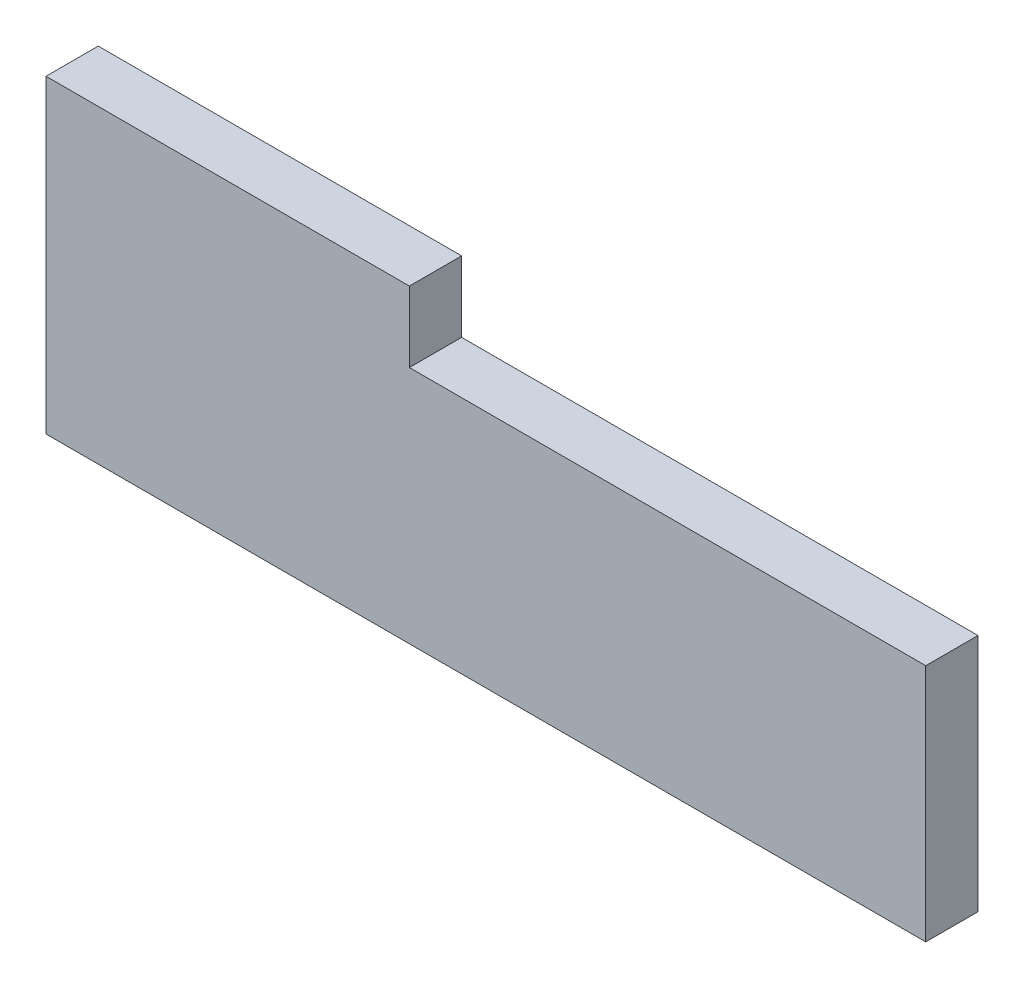
ISO-10303-21;
HEADER;
FILE_DESCRIPTION(('STEP AP214'),'2;1');
FILE_NAME('part.step','',(''),(''),'','','');
FILE_SCHEMA(('AUTOMOTIVE_DESIGN { 1 0 10303 214 1 1 1 1 }'));
ENDSEC;
DATA;
#1=APPLICATION_CONTEXT('core data for automotive mechanical design processes');
#2=APPLICATION_PROTOCOL_DEFINITION('international standard','automotive_design',2000,#1);
#3=PRODUCT_CONTEXT('',#1,'mechanical');
#4=PRODUCT('Part','Part','',(#3));
#5=PRODUCT_RELATED_PRODUCT_CATEGORY('part','',(#4));
#6=PRODUCT_DEFINITION_FORMATION('','',#4);
#7=PRODUCT_DEFINITION_CONTEXT('part definition',#1,'design');
#8=PRODUCT_DEFINITION('design','',#6,#7);
#9=PRODUCT_DEFINITION_SHAPE('','',#8);
#10=(LENGTH_UNIT() NAMED_UNIT(*) SI_UNIT(.MILLI.,.METRE.));
#11=(NAMED_UNIT(*) PLANE_ANGLE_UNIT() SI_UNIT($,.RADIAN.));
#12=(NAMED_UNIT(*) SI_UNIT($,.STERADIAN.) SOLID_ANGLE_UNIT());
#13=UNCERTAINTY_MEASURE_WITH_UNIT(LENGTH_MEASURE(1.E-05),#10,'distance_accuracy_value','');
#14=(GEOMETRIC_REPRESENTATION_CONTEXT(3) GLOBAL_UNCERTAINTY_ASSIGNED_CONTEXT((#13)) GLOBAL_UNIT_ASSIGNED_CONTEXT((#10,
#11,#12)) REPRESENTATION_CONTEXT('',''));
#15=CARTESIAN_POINT('',(0.,0.,0.));
#16=DIRECTION('',(0.,0.,1.));
#17=DIRECTION('',(1.,0.,0.));
#18=AXIS2_PLACEMENT_3D('',#15,#16,#17);
#19=CARTESIAN_POINT('',(2.50142870447465,0.195495938744602,1.905));
#20=DIRECTION('',(0.,0.,1.));
#21=DIRECTION('',(1.,0.,0.));
#22=AXIS2_PLACEMENT_3D('',#19,#20,#21);
#23=PLANE('',#22);
#24=DIRECTION('',(1.,0.,0.));
#25=VECTOR('',#24,1.);
#26=CARTESIAN_POINT('',(-4.89450675787917,7.12973810202919,1.905));
#27=LINE('',#26,#25);
#28=CARTESIAN_POINT('',(-18.1423675540325,7.12973810202919,1.905));
#29=VERTEX_POINT('',#28);
#30=CARTESIAN_POINT('',(-4.89450675787917,7.12973810202919,1.905));
#31=VERTEX_POINT('',#30);
#32=EDGE_CURVE('E71',#29,#31,#27,.T.);
#33=ORIENTED_EDGE('',*,*,#32,.F.);
#34=DIRECTION('',(0.,1.,0.));
#35=VECTOR('',#34,1.);
#36=CARTESIAN_POINT('',(-18.1423675540325,7.12973810202919,1.905));
#37=LINE('',#36,#35);
#38=CARTESIAN_POINT('',(-18.1423675540325,-4.16565855846622,1.905));
#39=VERTEX_POINT('',#38);
#40=EDGE_CURVE('E66',#39,#29,#37,.T.);
#41=ORIENTED_EDGE('',*,*,#40,.F.);
#42=DIRECTION('',(1.,0.,0.));
#43=VECTOR('',#42,1.);
#44=CARTESIAN_POINT('',(13.9314287044746,-4.16565855846622,1.905));
#45=LINE('',#44,#43);
#46=CARTESIAN_POINT('',(13.9314287044746,-4.16565855846622,1.905));
#47=VERTEX_POINT('',#46);
#48=EDGE_CURVE('E93',#47,#39,#45,.F.);
#49=ORIENTED_EDGE('',*,*,#48,.F.);
#50=DIRECTION('',(0.,1.,0.));
#51=VECTOR('',#50,1.);
#52=CARTESIAN_POINT('',(13.9314287044746,4.55665043595543,1.905));
#53=LINE('',#52,#51);
#54=CARTESIAN_POINT('',(13.9314287044746,4.55665043595543,1.905));
#55=VERTEX_POINT('',#54);
#56=EDGE_CURVE('E97',#55,#47,#53,.F.);
#57=ORIENTED_EDGE('',*,*,#56,.F.);
#58=DIRECTION('',(1.,0.,0.));
#59=VECTOR('',#58,1.);
#60=CARTESIAN_POINT('',(-8.92857129552535,4.55665043595543,1.905));
#61=LINE('',#60,#59);
#62=CARTESIAN_POINT('',(-4.89450675787917,4.55665043595543,1.905));
#63=VERTEX_POINT('',#62);
#64=EDGE_CURVE('E82',#63,#55,#61,.T.);
#65=ORIENTED_EDGE('',*,*,#64,.F.);
#66=DIRECTION('',(0.,1.,0.));
#67=VECTOR('',#66,1.);
#68=CARTESIAN_POINT('',(-4.89450675787917,-4.16565855846622,1.905));
#69=LINE('',#68,#67);
#70=EDGE_CURVE('E20',#31,#63,#69,.F.);
#71=ORIENTED_EDGE('',*,*,#70,.F.);
#72=EDGE_LOOP('',(#33,#41,#49,#57,#65,#71));
#73=FACE_BOUND('',#72,.T.);
#74=ADVANCED_FACE('F17',(#73),#23,.T.);
#75=CARTESIAN_POINT('',(-4.89450675787917,-4.16565855846622,1.905));
#76=DIRECTION('',(1.,0.,0.));
#77=DIRECTION('',(0.,0.,-1.));
#78=AXIS2_PLACEMENT_3D('',#75,#76,#77);
#79=PLANE('',#78);
#80=DIRECTION('',(0.,0.,1.));
#81=VECTOR('',#80,1.);
#82=CARTESIAN_POINT('',(-4.89450675787917,7.12973810202919,1.905));
#83=LINE('',#82,#81);
#84=CARTESIAN_POINT('',(-4.89450675787917,7.12973810202919,0.));
#85=VERTEX_POINT('',#84);
#86=EDGE_CURVE('E76',#31,#85,#83,.F.);
#87=ORIENTED_EDGE('',*,*,#86,.F.);
#88=ORIENTED_EDGE('',*,*,#70,.T.);
#89=DIRECTION('',(0.,0.,1.));
#90=VECTOR('',#89,1.);
#91=CARTESIAN_POINT('',(-4.89450675787917,4.55665043595543,0.));
#92=LINE('',#91,#90);
#93=CARTESIAN_POINT('',(-4.89450675787917,4.55665043595543,0.));
#94=VERTEX_POINT('',#93);
#95=EDGE_CURVE('E101',#94,#63,#92,.T.);
#96=ORIENTED_EDGE('',*,*,#95,.F.);
#97=DIRECTION('',(0.,1.,0.));
#98=VECTOR('',#97,1.);
#99=CARTESIAN_POINT('',(-4.89450675787917,0.195495938744602,0.));
#100=LINE('',#99,#98);
#101=EDGE_CURVE('E88',#94,#85,#100,.T.);
#102=ORIENTED_EDGE('',*,*,#101,.T.);
#103=EDGE_LOOP('',(#87,#88,#96,#102));
#104=FACE_BOUND('',#103,.T.);
#105=ADVANCED_FACE('F87',(#104),#79,.T.);
#106=CARTESIAN_POINT('',(-4.89450675787917,7.12973810202919,1.905));
#107=DIRECTION('',(0.,1.,0.));
#108=DIRECTION('',(0.,0.,1.));
#109=AXIS2_PLACEMENT_3D('',#106,#107,#108);
#110=PLANE('',#109);
#111=ORIENTED_EDGE('',*,*,#32,.T.);
#112=ORIENTED_EDGE('',*,*,#86,.T.);
#113=DIRECTION('',(1.,0.,0.));
#114=VECTOR('',#113,1.);
#115=CARTESIAN_POINT('',(2.50142870447465,7.12973810202919,0.));
#116=LINE('',#115,#114);
#117=CARTESIAN_POINT('',(-18.1423675540325,7.12973810202919,0.));
#118=VERTEX_POINT('',#117);
#119=EDGE_CURVE('E106',#85,#118,#116,.F.);
#120=ORIENTED_EDGE('',*,*,#119,.T.);
#121=DIRECTION('',(0.,0.,1.));
#122=VECTOR('',#121,1.);
#123=CARTESIAN_POINT('',(-18.1423675540325,7.12973810202919,1.905));
#124=LINE('',#123,#122);
#125=EDGE_CURVE('E78',#29,#118,#124,.F.);
#126=ORIENTED_EDGE('',*,*,#125,.F.);
#127=EDGE_LOOP('',(#111,#112,#120,#126));
#128=FACE_BOUND('',#127,.T.);
#129=ADVANCED_FACE('F73',(#128),#110,.T.);
#130=CARTESIAN_POINT('',(-18.1423675540325,7.12973810202919,1.905));
#131=DIRECTION('',(-1.,0.,0.));
#132=DIRECTION('',(0.,0.,1.));
#133=AXIS2_PLACEMENT_3D('',#130,#131,#132);
#134=PLANE('',#133);
#135=ORIENTED_EDGE('',*,*,#40,.T.);
#136=ORIENTED_EDGE('',*,*,#125,.T.);
#137=DIRECTION('',(0.,1.,0.));
#138=VECTOR('',#137,1.);
#139=CARTESIAN_POINT('',(-18.1423675540325,0.195495938744602,0.));
#140=LINE('',#139,#138);
#141=CARTESIAN_POINT('',(-18.1423675540325,-4.16565855846622,0.));
#142=VERTEX_POINT('',#141);
#143=EDGE_CURVE('E108',#118,#142,#140,.F.);
#144=ORIENTED_EDGE('',*,*,#143,.T.);
#145=DIRECTION('',(0.,0.,-1.));
#146=VECTOR('',#145,1.);
#147=CARTESIAN_POINT('',(-18.1423675540325,-4.16565855846622,0.));
#148=LINE('',#147,#146);
#149=EDGE_CURVE('E95',#39,#142,#148,.T.);
#150=ORIENTED_EDGE('',*,*,#149,.F.);
#151=EDGE_LOOP('',(#135,#136,#144,#150));
#152=FACE_BOUND('',#151,.T.);
#153=ADVANCED_FACE('F126',(#152),#134,.T.);
#154=CARTESIAN_POINT('',(13.9314287044746,-4.16565855846622,0.));
#155=DIRECTION('',(0.,-1.,0.));
#156=DIRECTION('',(0.,0.,-1.));
#157=AXIS2_PLACEMENT_3D('',#154,#155,#156);
#158=PLANE('',#157);
#159=ORIENTED_EDGE('',*,*,#48,.T.);
#160=ORIENTED_EDGE('',*,*,#149,.T.);
#161=DIRECTION('',(1.,0.,0.));
#162=VECTOR('',#161,1.);
#163=CARTESIAN_POINT('',(2.50142870447465,-4.16565855846622,0.));
#164=LINE('',#163,#162);
#165=CARTESIAN_POINT('',(13.9314287044746,-4.16565855846622,0.));
#166=VERTEX_POINT('',#165);
#167=EDGE_CURVE('E111',#142,#166,#164,.T.);
#168=ORIENTED_EDGE('',*,*,#167,.T.);
#169=DIRECTION('',(0.,0.,-1.));
#170=VECTOR('',#169,1.);
#171=CARTESIAN_POINT('',(13.9314287044746,-4.16565855846622,0.));
#172=LINE('',#171,#170);
#173=EDGE_CURVE('E99',#47,#166,#172,.T.);
#174=ORIENTED_EDGE('',*,*,#173,.F.);
#175=EDGE_LOOP('',(#159,#160,#168,#174));
#176=FACE_BOUND('',#175,.T.);
#177=ADVANCED_FACE('F124',(#176),#158,.T.);
#178=CARTESIAN_POINT('',(13.9314287044746,4.55665043595543,0.));
#179=DIRECTION('',(1.,0.,0.));
#180=DIRECTION('',(0.,0.,-1.));
#181=AXIS2_PLACEMENT_3D('',#178,#179,#180);
#182=PLANE('',#181);
#183=DIRECTION('',(0.,1.,0.));
#184=VECTOR('',#183,1.);
#185=CARTESIAN_POINT('',(13.9314287044746,0.195495938744602,0.));
#186=LINE('',#185,#184);
#187=CARTESIAN_POINT('',(13.9314287044746,4.55665043595543,0.));
#188=VERTEX_POINT('',#187);
#189=EDGE_CURVE('E26',#166,#188,#186,.T.);
#190=ORIENTED_EDGE('',*,*,#189,.T.);
#191=DIRECTION('',(0.,0.,1.));
#192=VECTOR('',#191,1.);
#193=CARTESIAN_POINT('',(13.9314287044746,4.55665043595543,0.));
#194=LINE('',#193,#192);
#195=EDGE_CURVE('E34',#55,#188,#194,.F.);
#196=ORIENTED_EDGE('',*,*,#195,.F.);
#197=ORIENTED_EDGE('',*,*,#56,.T.);
#198=ORIENTED_EDGE('',*,*,#173,.T.);
#199=EDGE_LOOP('',(#190,#196,#197,#198));
#200=FACE_BOUND('',#199,.T.);
#201=ADVANCED_FACE('F117',(#200),#182,.T.);
#202=CARTESIAN_POINT('',(-8.92857129552535,4.55665043595543,0.));
#203=DIRECTION('',(0.,1.,0.));
#204=DIRECTION('',(0.,0.,1.));
#205=AXIS2_PLACEMENT_3D('',#202,#203,#204);
#206=PLANE('',#205);
#207=ORIENTED_EDGE('',*,*,#195,.T.);
#208=DIRECTION('',(1.,0.,0.));
#209=VECTOR('',#208,1.);
#210=CARTESIAN_POINT('',(2.50142870447465,4.55665043595543,0.));
#211=LINE('',#210,#209);
#212=EDGE_CURVE('E11',#188,#94,#211,.F.);
#213=ORIENTED_EDGE('',*,*,#212,.T.);
#214=ORIENTED_EDGE('',*,*,#95,.T.);
#215=ORIENTED_EDGE('',*,*,#64,.T.);
#216=EDGE_LOOP('',(#207,#213,#214,#215));
#217=FACE_BOUND('',#216,.T.);
#218=ADVANCED_FACE('F127',(#217),#206,.T.);
#219=CARTESIAN_POINT('',(2.50142870447465,0.195495938744602,0.));
#220=DIRECTION('',(0.,0.,1.));
#221=DIRECTION('',(1.,0.,0.));
#222=AXIS2_PLACEMENT_3D('',#219,#220,#221);
#223=PLANE('',#222);
#224=ORIENTED_EDGE('',*,*,#189,.F.);
#225=ORIENTED_EDGE('',*,*,#167,.F.);
#226=ORIENTED_EDGE('',*,*,#143,.F.);
#227=ORIENTED_EDGE('',*,*,#119,.F.);
#228=ORIENTED_EDGE('',*,*,#101,.F.);
#229=ORIENTED_EDGE('',*,*,#212,.F.);
#230=EDGE_LOOP('',(#224,#225,#226,#227,#228,#229));
#231=FACE_BOUND('',#230,.T.);
#232=ADVANCED_FACE('F121',(#231),#223,.F.);
#233=CLOSED_SHELL('',(#74,#105,#129,#153,#177,#201,#218,#232));
#234=MANIFOLD_SOLID_BREP('B1',#233);
#235=ADVANCED_BREP_SHAPE_REPRESENTATION('',(#18,#234),#14);
#236=SHAPE_DEFINITION_REPRESENTATION(#9,#235);
ENDSEC;
END-ISO-10303-21;
